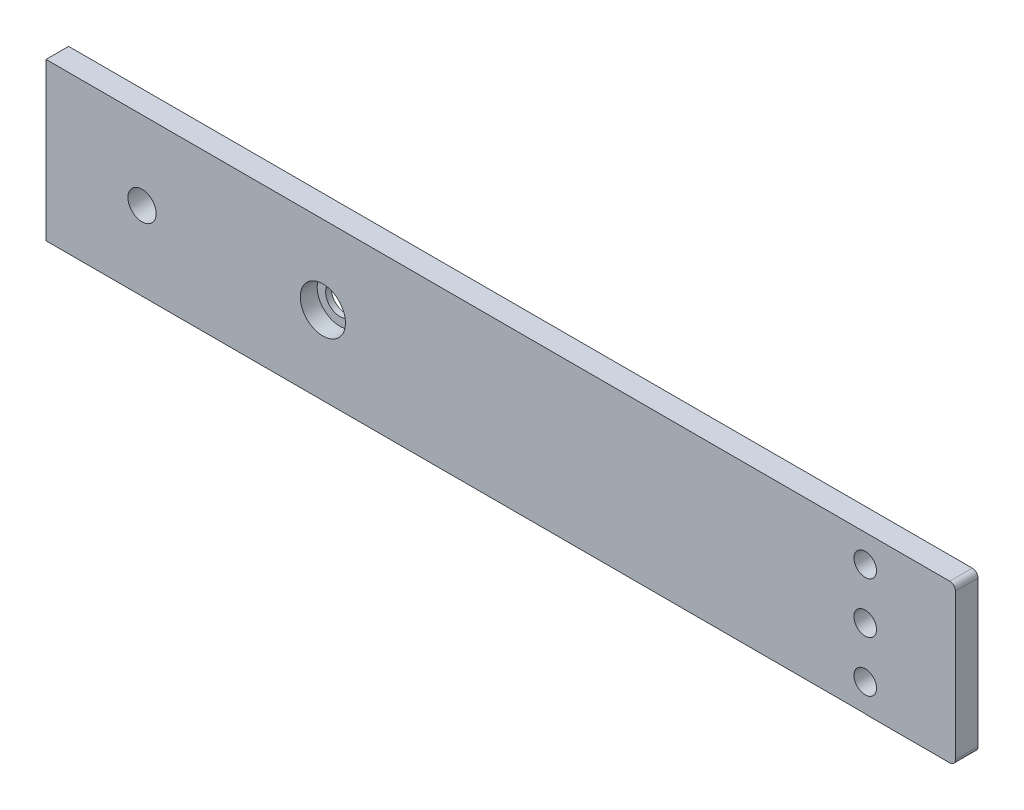
ISO-10303-21;
HEADER;
FILE_DESCRIPTION(('STEP AP214'),'2;1');
FILE_NAME('part.step','',(''),(''),'','','');
FILE_SCHEMA(('AUTOMOTIVE_DESIGN { 1 0 10303 214 1 1 1 1 }'));
ENDSEC;
DATA;
#1=APPLICATION_CONTEXT('core data for automotive mechanical design processes');
#2=APPLICATION_PROTOCOL_DEFINITION('international standard','automotive_design',2000,#1);
#3=PRODUCT_CONTEXT('',#1,'mechanical');
#4=PRODUCT('Part','Part','',(#3));
#5=PRODUCT_RELATED_PRODUCT_CATEGORY('part','',(#4));
#6=PRODUCT_DEFINITION_FORMATION('','',#4);
#7=PRODUCT_DEFINITION_CONTEXT('part definition',#1,'design');
#8=PRODUCT_DEFINITION('design','',#6,#7);
#9=PRODUCT_DEFINITION_SHAPE('','',#8);
#10=(LENGTH_UNIT() NAMED_UNIT(*) SI_UNIT(.MILLI.,.METRE.));
#11=(NAMED_UNIT(*) PLANE_ANGLE_UNIT() SI_UNIT($,.RADIAN.));
#12=(NAMED_UNIT(*) SI_UNIT($,.STERADIAN.) SOLID_ANGLE_UNIT());
#13=UNCERTAINTY_MEASURE_WITH_UNIT(LENGTH_MEASURE(1.E-05),#10,'distance_accuracy_value','');
#14=(GEOMETRIC_REPRESENTATION_CONTEXT(3) GLOBAL_UNCERTAINTY_ASSIGNED_CONTEXT((#13)) GLOBAL_UNIT_ASSIGNED_CONTEXT((#10,
#11,#12)) REPRESENTATION_CONTEXT('',''));
#15=CARTESIAN_POINT('',(0.,0.,0.));
#16=DIRECTION('',(0.,0.,1.));
#17=DIRECTION('',(1.,0.,0.));
#18=AXIS2_PLACEMENT_3D('',#15,#16,#17);
#19=CARTESIAN_POINT('',(-43.5386779184248,0.,4.));
#20=DIRECTION('',(0.,0.,-1.));
#21=DIRECTION('',(-1.,0.,0.));
#22=AXIS2_PLACEMENT_3D('',#19,#20,#21);
#23=CYLINDRICAL_SURFACE('',#22,2.5);
#24=CARTESIAN_POINT('',(-43.5386779184248,0.,0.));
#25=DIRECTION('',(0.,0.,1.));
#26=DIRECTION('',(1.,0.,0.));
#27=AXIS2_PLACEMENT_3D('',#24,#25,#26);
#28=CIRCLE('',#27,2.5);
#29=CARTESIAN_POINT('',(-41.0386779184247,0.,0.));
#30=VERTEX_POINT('',#29);
#31=EDGE_CURVE('E195',#30,#30,#28,.T.);
#32=ORIENTED_EDGE('',*,*,#31,.F.);
#33=EDGE_LOOP('',(#32));
#34=FACE_BOUND('',#33,.T.);
#35=CARTESIAN_POINT('',(-43.5386779184248,0.,1.));
#36=DIRECTION('',(0.,0.,1.));
#37=DIRECTION('',(1.,0.,0.));
#38=AXIS2_PLACEMENT_3D('',#35,#36,#37);
#39=CIRCLE('',#38,2.5);
#40=CARTESIAN_POINT('',(-41.0386779184247,0.,1.));
#41=VERTEX_POINT('',#40);
#42=EDGE_CURVE('E40',#41,#41,#39,.T.);
#43=ORIENTED_EDGE('',*,*,#42,.T.);
#44=EDGE_LOOP('',(#43));
#45=FACE_BOUND('',#44,.T.);
#46=ADVANCED_FACE('F36',(#34,#45),#23,.F.);
#47=CARTESIAN_POINT('',(67.4220728445616,-12.9500000000337,4.));
#48=DIRECTION('',(0.,0.,-1.));
#49=DIRECTION('',(-1.,0.,0.));
#50=AXIS2_PLACEMENT_3D('',#47,#48,#49);
#51=PLANE('',#50);
#52=CARTESIAN_POINT('',(-43.5386779184248,0.,4.));
#53=DIRECTION('',(0.,0.,1.));
#54=DIRECTION('',(1.,0.,0.));
#55=AXIS2_PLACEMENT_3D('',#52,#53,#54);
#56=CIRCLE('',#55,4.00000000000001);
#57=CARTESIAN_POINT('',(-39.5386779184247,0.,4.));
#58=VERTEX_POINT('',#57);
#59=EDGE_CURVE('E212',#58,#58,#56,.T.);
#60=ORIENTED_EDGE('',*,*,#59,.F.);
#61=EDGE_LOOP('',(#60));
#62=FACE_BOUND('',#61,.T.);
#63=CARTESIAN_POINT('',(52.4613220815658,-9.,4.));
#64=DIRECTION('',(0.,0.,-1.));
#65=DIRECTION('',(-1.,0.,0.));
#66=AXIS2_PLACEMENT_3D('',#63,#64,#65);
#67=CIRCLE('',#66,2.);
#68=CARTESIAN_POINT('',(50.4613220815658,-9.,4.));
#69=VERTEX_POINT('',#68);
#70=EDGE_CURVE('E200',#69,#69,#67,.T.);
#71=ORIENTED_EDGE('',*,*,#70,.T.);
#72=EDGE_LOOP('',(#71));
#73=FACE_BOUND('',#72,.T.);
#74=CARTESIAN_POINT('',(52.4613220815753,9.,4.));
#75=DIRECTION('',(0.,0.,-1.));
#76=DIRECTION('',(-1.,0.,0.));
#77=AXIS2_PLACEMENT_3D('',#74,#75,#76);
#78=CIRCLE('',#77,2.);
#79=CARTESIAN_POINT('',(50.4613220815752,9.,4.));
#80=VERTEX_POINT('',#79);
#81=EDGE_CURVE('E203',#80,#80,#78,.T.);
#82=ORIENTED_EDGE('',*,*,#81,.T.);
#83=EDGE_LOOP('',(#82));
#84=FACE_BOUND('',#83,.T.);
#85=DIRECTION('',(-1.,0.,0.));
#86=VECTOR('',#85,1.);
#87=CARTESIAN_POINT('',(-75.5386779184248,13.9,4.));
#88=LINE('',#87,#86);
#89=CARTESIAN_POINT('',(67.4220728445616,13.9,4.));
#90=VERTEX_POINT('',#89);
#91=CARTESIAN_POINT('',(-92.5386779184248,13.9,4.));
#92=VERTEX_POINT('',#91);
#93=EDGE_CURVE('E54',#90,#92,#88,.T.);
#94=ORIENTED_EDGE('',*,*,#93,.T.);
#95=DIRECTION('',(0.,-1.,0.));
#96=VECTOR('',#95,1.);
#97=CARTESIAN_POINT('',(-92.5386779184248,13.9,4.));
#98=LINE('',#97,#96);
#99=CARTESIAN_POINT('',(-92.5386779184248,-13.9,4.));
#100=VERTEX_POINT('',#99);
#101=EDGE_CURVE('E98',#92,#100,#98,.T.);
#102=ORIENTED_EDGE('',*,*,#101,.T.);
#103=DIRECTION('',(1.,0.,0.));
#104=VECTOR('',#103,1.);
#105=CARTESIAN_POINT('',(-92.5386779184248,-13.9,4.));
#106=LINE('',#105,#104);
#107=CARTESIAN_POINT('',(52.4613220815753,-13.9,4.));
#108=VERTEX_POINT('',#107);
#109=EDGE_CURVE('E169',#100,#108,#106,.T.);
#110=ORIENTED_EDGE('',*,*,#109,.T.);
#111=DIRECTION('',(0.,-1.,0.));
#112=VECTOR('',#111,1.);
#113=CARTESIAN_POINT('',(52.4613220815753,-13.9,4.));
#114=LINE('',#113,#112);
#115=CARTESIAN_POINT('',(52.4613220815753,-13.9500000000337,4.));
#116=VERTEX_POINT('',#115);
#117=EDGE_CURVE('E180',#108,#116,#114,.T.);
#118=ORIENTED_EDGE('',*,*,#117,.T.);
#119=DIRECTION('',(1.,0.,0.));
#120=VECTOR('',#119,1.);
#121=CARTESIAN_POINT('',(52.4613220815753,-13.9500000000337,4.));
#122=LINE('',#121,#120);
#123=CARTESIAN_POINT('',(67.4220728445616,-13.9500000000337,4.));
#124=VERTEX_POINT('',#123);
#125=EDGE_CURVE('E119',#116,#124,#122,.T.);
#126=ORIENTED_EDGE('',*,*,#125,.T.);
#127=CARTESIAN_POINT('',(67.4220728445616,-12.9500000000337,4.));
#128=DIRECTION('',(0.,0.,1.));
#129=DIRECTION('',(-1.,0.,0.));
#130=AXIS2_PLACEMENT_3D('',#127,#128,#129);
#131=CIRCLE('',#130,1.);
#132=CARTESIAN_POINT('',(68.4220728445616,-12.9500000000337,4.));
#133=VERTEX_POINT('',#132);
#134=EDGE_CURVE('E112',#124,#133,#131,.T.);
#135=ORIENTED_EDGE('',*,*,#134,.T.);
#136=DIRECTION('',(0.,1.,0.));
#137=VECTOR('',#136,1.);
#138=CARTESIAN_POINT('',(68.4220728445616,10.9,4.));
#139=LINE('',#138,#137);
#140=CARTESIAN_POINT('',(68.4220728445616,12.9,4.));
#141=VERTEX_POINT('',#140);
#142=EDGE_CURVE('E117',#133,#141,#139,.T.);
#143=ORIENTED_EDGE('',*,*,#142,.T.);
#144=CARTESIAN_POINT('',(67.4220728445616,12.9,4.));
#145=DIRECTION('',(0.,0.,1.));
#146=DIRECTION('',(-1.,0.,0.));
#147=AXIS2_PLACEMENT_3D('',#144,#145,#146);
#148=CIRCLE('',#147,1.);
#149=EDGE_CURVE('E134',#141,#90,#148,.T.);
#150=ORIENTED_EDGE('',*,*,#149,.T.);
#151=EDGE_LOOP('',(#94,#102,#110,#118,#126,#135,#143,#150));
#152=FACE_BOUND('',#151,.T.);
#153=CARTESIAN_POINT('',(-75.5386779184248,0.,4.));
#154=DIRECTION('',(0.,0.,1.));
#155=DIRECTION('',(1.,0.,0.));
#156=AXIS2_PLACEMENT_3D('',#153,#154,#155);
#157=CIRCLE('',#156,2.5);
#158=CARTESIAN_POINT('',(-73.0386779184248,0.,4.));
#159=VERTEX_POINT('',#158);
#160=EDGE_CURVE('E144',#159,#159,#157,.T.);
#161=ORIENTED_EDGE('',*,*,#160,.F.);
#162=EDGE_LOOP('',(#161));
#163=FACE_BOUND('',#162,.T.);
#164=CARTESIAN_POINT('',(52.4613220815753,0.,4.));
#165=DIRECTION('',(0.,0.,1.));
#166=DIRECTION('',(1.,0.,0.));
#167=AXIS2_PLACEMENT_3D('',#164,#165,#166);
#168=CIRCLE('',#167,2.);
#169=CARTESIAN_POINT('',(54.4613220815753,0.,4.));
#170=VERTEX_POINT('',#169);
#171=EDGE_CURVE('E189',#170,#170,#168,.T.);
#172=ORIENTED_EDGE('',*,*,#171,.F.);
#173=EDGE_LOOP('',(#172));
#174=FACE_BOUND('',#173,.T.);
#175=ADVANCED_FACE('F114',(#62,#73,#84,#152,#163,#174),#51,.F.);
#176=CARTESIAN_POINT('',(67.4220728445616,-12.9500000000337,0.));
#177=DIRECTION('',(0.,0.,-1.));
#178=DIRECTION('',(-1.,0.,0.));
#179=AXIS2_PLACEMENT_3D('',#176,#177,#178);
#180=PLANE('',#179);
#181=CARTESIAN_POINT('',(52.4613220815658,-9.,0.));
#182=DIRECTION('',(0.,0.,-1.));
#183=DIRECTION('',(-1.,0.,0.));
#184=AXIS2_PLACEMENT_3D('',#181,#182,#183);
#185=CIRCLE('',#184,2.);
#186=CARTESIAN_POINT('',(50.4613220815658,-9.,0.));
#187=VERTEX_POINT('',#186);
#188=EDGE_CURVE('E206',#187,#187,#185,.T.);
#189=ORIENTED_EDGE('',*,*,#188,.F.);
#190=EDGE_LOOP('',(#189));
#191=FACE_BOUND('',#190,.T.);
#192=CARTESIAN_POINT('',(52.4613220815753,9.,0.));
#193=DIRECTION('',(0.,0.,-1.));
#194=DIRECTION('',(-1.,0.,0.));
#195=AXIS2_PLACEMENT_3D('',#192,#193,#194);
#196=CIRCLE('',#195,2.);
#197=CARTESIAN_POINT('',(50.4613220815752,9.,0.));
#198=VERTEX_POINT('',#197);
#199=EDGE_CURVE('E207',#198,#198,#196,.T.);
#200=ORIENTED_EDGE('',*,*,#199,.F.);
#201=EDGE_LOOP('',(#200));
#202=FACE_BOUND('',#201,.T.);
#203=CARTESIAN_POINT('',(52.4613220815753,0.,0.));
#204=DIRECTION('',(0.,0.,1.));
#205=DIRECTION('',(1.,0.,0.));
#206=AXIS2_PLACEMENT_3D('',#203,#204,#205);
#207=CIRCLE('',#206,2.);
#208=CARTESIAN_POINT('',(54.4613220815753,0.,0.));
#209=VERTEX_POINT('',#208);
#210=EDGE_CURVE('E192',#209,#209,#207,.T.);
#211=ORIENTED_EDGE('',*,*,#210,.T.);
#212=EDGE_LOOP('',(#211));
#213=FACE_BOUND('',#212,.T.);
#214=DIRECTION('',(0.,-1.,0.));
#215=VECTOR('',#214,1.);
#216=CARTESIAN_POINT('',(-92.5386779184248,13.9,0.));
#217=LINE('',#216,#215);
#218=CARTESIAN_POINT('',(-92.5386779184248,13.9,0.));
#219=VERTEX_POINT('',#218);
#220=CARTESIAN_POINT('',(-92.5386779184248,-13.9,0.));
#221=VERTEX_POINT('',#220);
#222=EDGE_CURVE('E140',#219,#221,#217,.T.);
#223=ORIENTED_EDGE('',*,*,#222,.F.);
#224=DIRECTION('',(-1.,0.,0.));
#225=VECTOR('',#224,1.);
#226=CARTESIAN_POINT('',(-75.5386779184248,13.9,0.));
#227=LINE('',#226,#225);
#228=CARTESIAN_POINT('',(67.4220728445616,13.9,0.));
#229=VERTEX_POINT('',#228);
#230=EDGE_CURVE('E90',#229,#219,#227,.T.);
#231=ORIENTED_EDGE('',*,*,#230,.F.);
#232=CARTESIAN_POINT('',(67.4220728445616,12.9,0.));
#233=DIRECTION('',(0.,0.,1.));
#234=DIRECTION('',(-1.,0.,0.));
#235=AXIS2_PLACEMENT_3D('',#232,#233,#234);
#236=CIRCLE('',#235,1.);
#237=CARTESIAN_POINT('',(68.4220728445616,12.9,0.));
#238=VERTEX_POINT('',#237);
#239=EDGE_CURVE('E152',#238,#229,#236,.T.);
#240=ORIENTED_EDGE('',*,*,#239,.F.);
#241=DIRECTION('',(0.,1.,0.));
#242=VECTOR('',#241,1.);
#243=CARTESIAN_POINT('',(68.4220728445616,12.9,0.));
#244=LINE('',#243,#242);
#245=CARTESIAN_POINT('',(68.4220728445616,-12.9500000000337,0.));
#246=VERTEX_POINT('',#245);
#247=EDGE_CURVE('E83',#246,#238,#244,.T.);
#248=ORIENTED_EDGE('',*,*,#247,.F.);
#249=CARTESIAN_POINT('',(67.4220728445616,-12.9500000000337,0.));
#250=DIRECTION('',(0.,0.,1.));
#251=DIRECTION('',(-1.,0.,0.));
#252=AXIS2_PLACEMENT_3D('',#249,#250,#251);
#253=CIRCLE('',#252,1.);
#254=CARTESIAN_POINT('',(67.4220728445616,-13.9500000000337,0.));
#255=VERTEX_POINT('',#254);
#256=EDGE_CURVE('E128',#255,#246,#253,.T.);
#257=ORIENTED_EDGE('',*,*,#256,.F.);
#258=DIRECTION('',(1.,0.,0.));
#259=VECTOR('',#258,1.);
#260=CARTESIAN_POINT('',(52.4613220815753,-13.9500000000337,0.));
#261=LINE('',#260,#259);
#262=CARTESIAN_POINT('',(52.4613220815753,-13.9500000000337,0.));
#263=VERTEX_POINT('',#262);
#264=EDGE_CURVE('E148',#263,#255,#261,.T.);
#265=ORIENTED_EDGE('',*,*,#264,.F.);
#266=DIRECTION('',(0.,-1.,0.));
#267=VECTOR('',#266,1.);
#268=CARTESIAN_POINT('',(52.4613220815753,-13.9,0.));
#269=LINE('',#268,#267);
#270=CARTESIAN_POINT('',(52.4613220815753,-13.9,0.));
#271=VERTEX_POINT('',#270);
#272=EDGE_CURVE('E146',#271,#263,#269,.T.);
#273=ORIENTED_EDGE('',*,*,#272,.F.);
#274=DIRECTION('',(1.,0.,0.));
#275=VECTOR('',#274,1.);
#276=CARTESIAN_POINT('',(-75.5386779184248,-13.9,0.));
#277=LINE('',#276,#275);
#278=EDGE_CURVE('E143',#221,#271,#277,.T.);
#279=ORIENTED_EDGE('',*,*,#278,.F.);
#280=EDGE_LOOP('',(#223,#231,#240,#248,#257,#265,#273,#279));
#281=FACE_BOUND('',#280,.T.);
#282=CARTESIAN_POINT('',(-75.5386779184248,0.,0.));
#283=DIRECTION('',(0.,0.,1.));
#284=DIRECTION('',(1.,0.,0.));
#285=AXIS2_PLACEMENT_3D('',#282,#283,#284);
#286=CIRCLE('',#285,2.5);
#287=CARTESIAN_POINT('',(-73.0386779184248,0.,0.));
#288=VERTEX_POINT('',#287);
#289=EDGE_CURVE('E186',#288,#288,#286,.T.);
#290=ORIENTED_EDGE('',*,*,#289,.T.);
#291=EDGE_LOOP('',(#290));
#292=FACE_BOUND('',#291,.T.);
#293=ORIENTED_EDGE('',*,*,#31,.T.);
#294=EDGE_LOOP('',(#293));
#295=FACE_BOUND('',#294,.T.);
#296=ADVANCED_FACE('F170',(#191,#202,#213,#281,#292,#295),#180,.T.);
#297=CARTESIAN_POINT('',(-92.5386779184248,13.9,4.));
#298=DIRECTION('',(1.,0.,0.));
#299=DIRECTION('',(0.,0.,-1.));
#300=AXIS2_PLACEMENT_3D('',#297,#298,#299);
#301=PLANE('',#300);
#302=ORIENTED_EDGE('',*,*,#222,.T.);
#303=DIRECTION('',(0.,0.,-1.));
#304=VECTOR('',#303,1.);
#305=CARTESIAN_POINT('',(-92.5386779184248,-13.9,4.));
#306=LINE('',#305,#304);
#307=EDGE_CURVE('E46',#100,#221,#306,.T.);
#308=ORIENTED_EDGE('',*,*,#307,.F.);
#309=ORIENTED_EDGE('',*,*,#101,.F.);
#310=DIRECTION('',(0.,0.,-1.));
#311=VECTOR('',#310,1.);
#312=CARTESIAN_POINT('',(-92.5386779184248,13.9,4.));
#313=LINE('',#312,#311);
#314=EDGE_CURVE('E11',#92,#219,#313,.T.);
#315=ORIENTED_EDGE('',*,*,#314,.T.);
#316=EDGE_LOOP('',(#302,#308,#309,#315));
#317=FACE_BOUND('',#316,.T.);
#318=ADVANCED_FACE('F38',(#317),#301,.F.);
#319=CARTESIAN_POINT('',(-75.5386779184248,-13.9,4.));
#320=DIRECTION('',(0.,1.,0.));
#321=DIRECTION('',(0.,0.,1.));
#322=AXIS2_PLACEMENT_3D('',#319,#320,#321);
#323=PLANE('',#322);
#324=ORIENTED_EDGE('',*,*,#278,.T.);
#325=DIRECTION('',(0.,0.,-1.));
#326=VECTOR('',#325,1.);
#327=CARTESIAN_POINT('',(52.4613220815753,-13.9,4.));
#328=LINE('',#327,#326);
#329=EDGE_CURVE('E161',#108,#271,#328,.T.);
#330=ORIENTED_EDGE('',*,*,#329,.F.);
#331=ORIENTED_EDGE('',*,*,#109,.F.);
#332=ORIENTED_EDGE('',*,*,#307,.T.);
#333=EDGE_LOOP('',(#324,#330,#331,#332));
#334=FACE_BOUND('',#333,.T.);
#335=ADVANCED_FACE('F167',(#334),#323,.F.);
#336=CARTESIAN_POINT('',(52.4613220815753,-13.9,4.));
#337=DIRECTION('',(1.,0.,0.));
#338=DIRECTION('',(0.,0.,-1.));
#339=AXIS2_PLACEMENT_3D('',#336,#337,#338);
#340=PLANE('',#339);
#341=ORIENTED_EDGE('',*,*,#272,.T.);
#342=DIRECTION('',(0.,0.,-1.));
#343=VECTOR('',#342,1.);
#344=CARTESIAN_POINT('',(52.4613220815753,-13.9500000000337,4.));
#345=LINE('',#344,#343);
#346=EDGE_CURVE('E158',#116,#263,#345,.T.);
#347=ORIENTED_EDGE('',*,*,#346,.F.);
#348=ORIENTED_EDGE('',*,*,#117,.F.);
#349=ORIENTED_EDGE('',*,*,#329,.T.);
#350=EDGE_LOOP('',(#341,#347,#348,#349));
#351=FACE_BOUND('',#350,.T.);
#352=ADVANCED_FACE('F176',(#351),#340,.F.);
#353=CARTESIAN_POINT('',(52.4613220815753,-13.9500000000337,4.));
#354=DIRECTION('',(0.,1.,0.));
#355=DIRECTION('',(0.,0.,1.));
#356=AXIS2_PLACEMENT_3D('',#353,#354,#355);
#357=PLANE('',#356);
#358=ORIENTED_EDGE('',*,*,#264,.T.);
#359=DIRECTION('',(0.,0.,-1.));
#360=VECTOR('',#359,1.);
#361=CARTESIAN_POINT('',(67.4220728445616,-13.9500000000337,4.));
#362=LINE('',#361,#360);
#363=EDGE_CURVE('E129',#124,#255,#362,.T.);
#364=ORIENTED_EDGE('',*,*,#363,.F.);
#365=ORIENTED_EDGE('',*,*,#125,.F.);
#366=ORIENTED_EDGE('',*,*,#346,.T.);
#367=EDGE_LOOP('',(#358,#364,#365,#366));
#368=FACE_BOUND('',#367,.T.);
#369=ADVANCED_FACE('F179',(#368),#357,.F.);
#370=CARTESIAN_POINT('',(67.4220728445616,-12.9500000000337,4.));
#371=DIRECTION('',(0.,0.,-1.));
#372=DIRECTION('',(-1.,0.,0.));
#373=AXIS2_PLACEMENT_3D('',#370,#371,#372);
#374=CYLINDRICAL_SURFACE('',#373,1.);
#375=ORIENTED_EDGE('',*,*,#256,.T.);
#376=DIRECTION('',(0.,0.,-1.));
#377=VECTOR('',#376,1.);
#378=CARTESIAN_POINT('',(68.4220728445616,-12.9500000000337,4.));
#379=LINE('',#378,#377);
#380=EDGE_CURVE('E125',#133,#246,#379,.T.);
#381=ORIENTED_EDGE('',*,*,#380,.F.);
#382=ORIENTED_EDGE('',*,*,#134,.F.);
#383=ORIENTED_EDGE('',*,*,#363,.T.);
#384=EDGE_LOOP('',(#375,#381,#382,#383));
#385=FACE_BOUND('',#384,.T.);
#386=ADVANCED_FACE('F126',(#385),#374,.T.);
#387=CARTESIAN_POINT('',(68.4220728445616,12.9,4.));
#388=DIRECTION('',(-1.,0.,0.));
#389=DIRECTION('',(0.,0.,1.));
#390=AXIS2_PLACEMENT_3D('',#387,#388,#389);
#391=PLANE('',#390);
#392=ORIENTED_EDGE('',*,*,#247,.T.);
#393=DIRECTION('',(0.,0.,-1.));
#394=VECTOR('',#393,1.);
#395=CARTESIAN_POINT('',(68.4220728445616,12.9,4.));
#396=LINE('',#395,#394);
#397=EDGE_CURVE('E130',#141,#238,#396,.T.);
#398=ORIENTED_EDGE('',*,*,#397,.F.);
#399=ORIENTED_EDGE('',*,*,#142,.F.);
#400=ORIENTED_EDGE('',*,*,#380,.T.);
#401=EDGE_LOOP('',(#392,#398,#399,#400));
#402=FACE_BOUND('',#401,.T.);
#403=ADVANCED_FACE('F132',(#402),#391,.F.);
#404=CARTESIAN_POINT('',(67.4220728445616,12.9,4.));
#405=DIRECTION('',(0.,0.,-1.));
#406=DIRECTION('',(-1.,0.,0.));
#407=AXIS2_PLACEMENT_3D('',#404,#405,#406);
#408=CYLINDRICAL_SURFACE('',#407,1.);
#409=ORIENTED_EDGE('',*,*,#239,.T.);
#410=DIRECTION('',(0.,0.,-1.));
#411=VECTOR('',#410,1.);
#412=CARTESIAN_POINT('',(67.4220728445616,13.9,4.));
#413=LINE('',#412,#411);
#414=EDGE_CURVE('E136',#90,#229,#413,.T.);
#415=ORIENTED_EDGE('',*,*,#414,.F.);
#416=ORIENTED_EDGE('',*,*,#149,.F.);
#417=ORIENTED_EDGE('',*,*,#397,.T.);
#418=EDGE_LOOP('',(#409,#415,#416,#417));
#419=FACE_BOUND('',#418,.T.);
#420=ADVANCED_FACE('F260',(#419),#408,.T.);
#421=CARTESIAN_POINT('',(-75.5386779184248,13.9,4.));
#422=DIRECTION('',(0.,-1.,0.));
#423=DIRECTION('',(0.,0.,-1.));
#424=AXIS2_PLACEMENT_3D('',#421,#422,#423);
#425=PLANE('',#424);
#426=ORIENTED_EDGE('',*,*,#230,.T.);
#427=ORIENTED_EDGE('',*,*,#314,.F.);
#428=ORIENTED_EDGE('',*,*,#93,.F.);
#429=ORIENTED_EDGE('',*,*,#414,.T.);
#430=EDGE_LOOP('',(#426,#427,#428,#429));
#431=FACE_BOUND('',#430,.T.);
#432=ADVANCED_FACE('F252',(#431),#425,.F.);
#433=CARTESIAN_POINT('',(-75.5386779184248,0.,4.));
#434=DIRECTION('',(0.,0.,-1.));
#435=DIRECTION('',(-1.,0.,0.));
#436=AXIS2_PLACEMENT_3D('',#433,#434,#435);
#437=CYLINDRICAL_SURFACE('',#436,2.5);
#438=ORIENTED_EDGE('',*,*,#160,.T.);
#439=EDGE_LOOP('',(#438));
#440=FACE_BOUND('',#439,.T.);
#441=ORIENTED_EDGE('',*,*,#289,.F.);
#442=EDGE_LOOP('',(#441));
#443=FACE_BOUND('',#442,.T.);
#444=ADVANCED_FACE('F249',(#440,#443),#437,.F.);
#445=CARTESIAN_POINT('',(52.4613220815753,0.,4.));
#446=DIRECTION('',(0.,0.,-1.));
#447=DIRECTION('',(-1.,0.,0.));
#448=AXIS2_PLACEMENT_3D('',#445,#446,#447);
#449=CYLINDRICAL_SURFACE('',#448,2.);
#450=ORIENTED_EDGE('',*,*,#171,.T.);
#451=EDGE_LOOP('',(#450));
#452=FACE_BOUND('',#451,.T.);
#453=ORIENTED_EDGE('',*,*,#210,.F.);
#454=EDGE_LOOP('',(#453));
#455=FACE_BOUND('',#454,.T.);
#456=ADVANCED_FACE('F246',(#452,#455),#449,.F.);
#457=CARTESIAN_POINT('',(52.4613220815753,9.,10.));
#458=DIRECTION('',(0.,0.,-1.));
#459=DIRECTION('',(-1.,0.,0.));
#460=AXIS2_PLACEMENT_3D('',#457,#458,#459);
#461=CYLINDRICAL_SURFACE('',#460,2.);
#462=ORIENTED_EDGE('',*,*,#199,.T.);
#463=EDGE_LOOP('',(#462));
#464=FACE_BOUND('',#463,.T.);
#465=ORIENTED_EDGE('',*,*,#81,.F.);
#466=EDGE_LOOP('',(#465));
#467=FACE_BOUND('',#466,.T.);
#468=ADVANCED_FACE('F244',(#464,#467),#461,.F.);
#469=CARTESIAN_POINT('',(52.4613220815658,-9.,10.));
#470=DIRECTION('',(0.,0.,-1.));
#471=DIRECTION('',(-1.,0.,0.));
#472=AXIS2_PLACEMENT_3D('',#469,#470,#471);
#473=CYLINDRICAL_SURFACE('',#472,2.);
#474=ORIENTED_EDGE('',*,*,#188,.T.);
#475=EDGE_LOOP('',(#474));
#476=FACE_BOUND('',#475,.T.);
#477=ORIENTED_EDGE('',*,*,#70,.F.);
#478=EDGE_LOOP('',(#477));
#479=FACE_BOUND('',#478,.T.);
#480=ADVANCED_FACE('F230',(#476,#479),#473,.F.);
#481=CARTESIAN_POINT('',(-43.5386779184248,0.,1.));
#482=DIRECTION('',(0.,0.,1.));
#483=DIRECTION('',(1.,0.,0.));
#484=AXIS2_PLACEMENT_3D('',#481,#482,#483);
#485=CYLINDRICAL_SURFACE('',#484,4.00000000000001);
#486=CARTESIAN_POINT('',(-43.5386779184248,0.,1.));
#487=DIRECTION('',(0.,0.,1.));
#488=DIRECTION('',(1.,0.,0.));
#489=AXIS2_PLACEMENT_3D('',#486,#487,#488);
#490=CIRCLE('',#489,4.00000000000001);
#491=CARTESIAN_POINT('',(-39.5386779184247,0.,1.));
#492=VERTEX_POINT('',#491);
#493=EDGE_CURVE('E215',#492,#492,#490,.T.);
#494=ORIENTED_EDGE('',*,*,#493,.F.);
#495=EDGE_LOOP('',(#494));
#496=FACE_BOUND('',#495,.T.);
#497=ORIENTED_EDGE('',*,*,#59,.T.);
#498=EDGE_LOOP('',(#497));
#499=FACE_BOUND('',#498,.T.);
#500=ADVANCED_FACE('F225',(#496,#499),#485,.F.);
#501=CARTESIAN_POINT('',(-43.5386779184248,0.,1.));
#502=DIRECTION('',(0.,0.,1.));
#503=DIRECTION('',(1.,0.,0.));
#504=AXIS2_PLACEMENT_3D('',#501,#502,#503);
#505=PLANE('',#504);
#506=ORIENTED_EDGE('',*,*,#42,.F.);
#507=EDGE_LOOP('',(#506));
#508=FACE_BOUND('',#507,.T.);
#509=ORIENTED_EDGE('',*,*,#493,.T.);
#510=EDGE_LOOP('',(#509));
#511=FACE_BOUND('',#510,.T.);
#512=ADVANCED_FACE('F223',(#508,#511),#505,.T.);
#513=CLOSED_SHELL('',(#46,#175,#296,#318,#335,#352,#369,#386,#403,#420,#432,#444,#456,#468,#480,
#500,#512));
#514=MANIFOLD_SOLID_BREP('B2',#513);
#515=ADVANCED_BREP_SHAPE_REPRESENTATION('',(#18,#514),#14);
#516=SHAPE_DEFINITION_REPRESENTATION(#9,#515);
ENDSEC;
END-ISO-10303-21;
